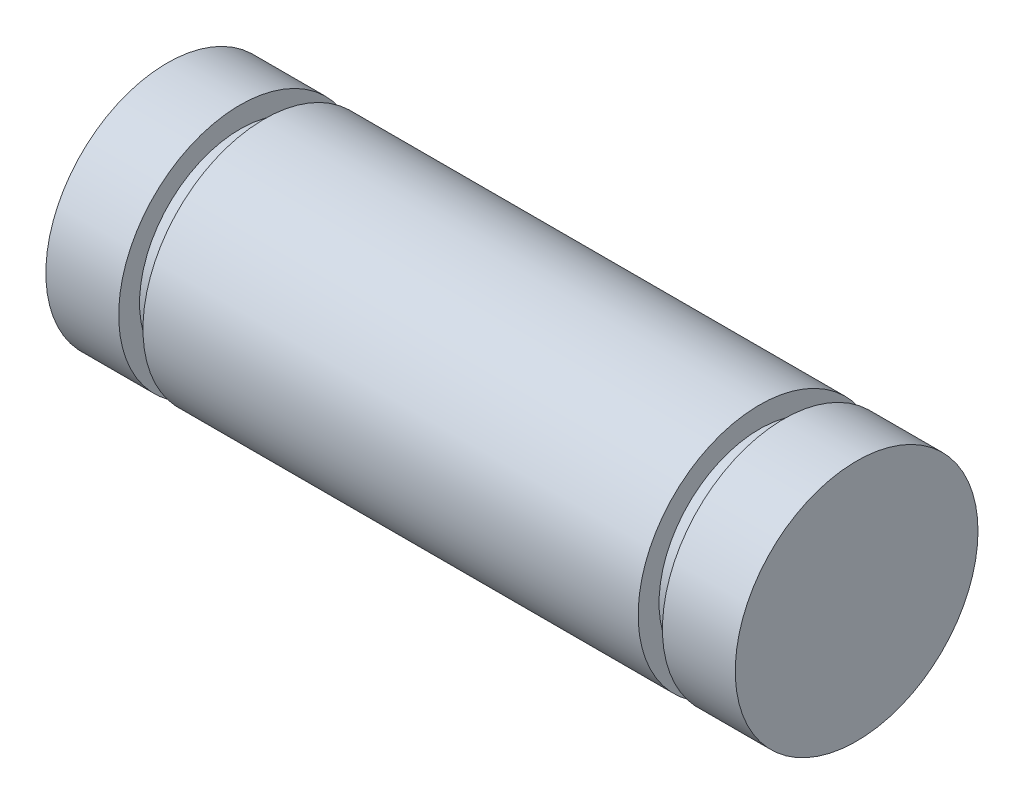
ISO-10303-21;
HEADER;
FILE_DESCRIPTION(('STEP AP214'),'2;1');
FILE_NAME('part.step','',(''),(''),'','','');
FILE_SCHEMA(('AUTOMOTIVE_DESIGN { 1 0 10303 214 1 1 1 1 }'));
ENDSEC;
DATA;
#1=APPLICATION_CONTEXT('core data for automotive mechanical design processes');
#2=APPLICATION_PROTOCOL_DEFINITION('international standard','automotive_design',2000,#1);
#3=PRODUCT_CONTEXT('',#1,'mechanical');
#4=PRODUCT('Part','Part','',(#3));
#5=PRODUCT_RELATED_PRODUCT_CATEGORY('part','',(#4));
#6=PRODUCT_DEFINITION_FORMATION('','',#4);
#7=PRODUCT_DEFINITION_CONTEXT('part definition',#1,'design');
#8=PRODUCT_DEFINITION('design','',#6,#7);
#9=PRODUCT_DEFINITION_SHAPE('','',#8);
#10=(LENGTH_UNIT() NAMED_UNIT(*) SI_UNIT(.MILLI.,.METRE.));
#11=(NAMED_UNIT(*) PLANE_ANGLE_UNIT() SI_UNIT($,.RADIAN.));
#12=(NAMED_UNIT(*) SI_UNIT($,.STERADIAN.) SOLID_ANGLE_UNIT());
#13=UNCERTAINTY_MEASURE_WITH_UNIT(LENGTH_MEASURE(1.E-05),#10,'distance_accuracy_value','');
#14=(GEOMETRIC_REPRESENTATION_CONTEXT(3) GLOBAL_UNCERTAINTY_ASSIGNED_CONTEXT((#13)) GLOBAL_UNIT_ASSIGNED_CONTEXT((#10,
#11,#12)) REPRESENTATION_CONTEXT('',''));
#15=CARTESIAN_POINT('',(0.,0.,0.));
#16=DIRECTION('',(0.,0.,1.));
#17=DIRECTION('',(1.,0.,0.));
#18=AXIS2_PLACEMENT_3D('',#15,#16,#17);
#19=CARTESIAN_POINT('',(9.017,0.,0.));
#20=DIRECTION('',(-1.,0.,0.));
#21=DIRECTION('',(0.,0.,1.));
#22=AXIS2_PLACEMENT_3D('',#19,#20,#21);
#23=CYLINDRICAL_SURFACE('',#22,3.175);
#24=CARTESIAN_POINT('',(6.477,0.,0.));
#25=DIRECTION('',(1.,0.,0.));
#26=DIRECTION('',(0.,0.,-1.));
#27=AXIS2_PLACEMENT_3D('',#24,#25,#26);
#28=CIRCLE('',#27,3.175);
#29=CARTESIAN_POINT('',(6.477,0.,-3.175));
#30=VERTEX_POINT('',#29);
#31=EDGE_CURVE('E57',#30,#30,#28,.T.);
#32=ORIENTED_EDGE('',*,*,#31,.F.);
#33=EDGE_LOOP('',(#32));
#34=FACE_BOUND('',#33,.T.);
#35=CARTESIAN_POINT('',(-6.477,0.,0.));
#36=DIRECTION('',(1.,0.,0.));
#37=DIRECTION('',(0.,0.,-1.));
#38=AXIS2_PLACEMENT_3D('',#35,#36,#37);
#39=CIRCLE('',#38,3.175);
#40=CARTESIAN_POINT('',(-6.477,0.,-3.175));
#41=VERTEX_POINT('',#40);
#42=EDGE_CURVE('E51',#41,#41,#39,.T.);
#43=ORIENTED_EDGE('',*,*,#42,.T.);
#44=EDGE_LOOP('',(#43));
#45=FACE_BOUND('',#44,.T.);
#46=ADVANCED_FACE('F33',(#34,#45),#23,.T.);
#47=CARTESIAN_POINT('',(-7.112,0.,0.));
#48=DIRECTION('',(1.,0.,0.));
#49=DIRECTION('',(0.,0.,-1.));
#50=AXIS2_PLACEMENT_3D('',#47,#48,#49);
#51=CIRCLE('',#50,3.175);
#52=CARTESIAN_POINT('',(-7.112,0.,-3.175));
#53=VERTEX_POINT('',#52);
#54=EDGE_CURVE('E54',#53,#53,#51,.T.);
#55=ORIENTED_EDGE('',*,*,#54,.F.);
#56=EDGE_LOOP('',(#55));
#57=FACE_BOUND('',#56,.T.);
#58=CARTESIAN_POINT('',(-9.017,0.,0.));
#59=DIRECTION('',(1.,0.,0.));
#60=DIRECTION('',(0.,0.,-1.));
#61=AXIS2_PLACEMENT_3D('',#58,#59,#60);
#62=CIRCLE('',#61,3.175);
#63=CARTESIAN_POINT('',(-9.017,0.,-3.175));
#64=VERTEX_POINT('',#63);
#65=EDGE_CURVE('E37',#64,#64,#62,.T.);
#66=ORIENTED_EDGE('',*,*,#65,.T.);
#67=EDGE_LOOP('',(#66));
#68=FACE_BOUND('',#67,.T.);
#69=ADVANCED_FACE('F94',(#57,#68),#23,.T.);
#70=CARTESIAN_POINT('',(-9.017,0.,0.));
#71=DIRECTION('',(1.,0.,0.));
#72=DIRECTION('',(0.,0.,-1.));
#73=AXIS2_PLACEMENT_3D('',#70,#71,#72);
#74=PLANE('',#73);
#75=ORIENTED_EDGE('',*,*,#65,.F.);
#76=EDGE_LOOP('',(#75));
#77=FACE_BOUND('',#76,.T.);
#78=ADVANCED_FACE('F111',(#77),#74,.F.);
#79=CARTESIAN_POINT('',(-7.112,3.175,0.));
#80=DIRECTION('',(-1.,0.,0.));
#81=DIRECTION('',(0.,0.,1.));
#82=AXIS2_PLACEMENT_3D('',#79,#80,#81);
#83=PLANE('',#82);
#84=CARTESIAN_POINT('',(-7.112,0.,0.));
#85=DIRECTION('',(1.,0.,0.));
#86=DIRECTION('',(0.,0.,-1.));
#87=AXIS2_PLACEMENT_3D('',#84,#85,#86);
#88=CIRCLE('',#87,2.6289);
#89=CARTESIAN_POINT('',(-7.112,0.,-2.6289));
#90=VERTEX_POINT('',#89);
#91=EDGE_CURVE('E44',#90,#90,#88,.T.);
#92=ORIENTED_EDGE('',*,*,#91,.F.);
#93=EDGE_LOOP('',(#92));
#94=FACE_BOUND('',#93,.T.);
#95=ORIENTED_EDGE('',*,*,#54,.T.);
#96=EDGE_LOOP('',(#95));
#97=FACE_BOUND('',#96,.T.);
#98=ADVANCED_FACE('F105',(#94,#97),#83,.F.);
#99=CARTESIAN_POINT('',(0.,0.,0.));
#100=DIRECTION('',(1.,0.,0.));
#101=DIRECTION('',(0.,0.,-1.));
#102=AXIS2_PLACEMENT_3D('',#99,#100,#101);
#103=CYLINDRICAL_SURFACE('',#102,2.6289);
#104=CARTESIAN_POINT('',(-6.477,0.,0.));
#105=DIRECTION('',(1.,0.,0.));
#106=DIRECTION('',(0.,0.,-1.));
#107=AXIS2_PLACEMENT_3D('',#104,#105,#106);
#108=CIRCLE('',#107,2.6289);
#109=CARTESIAN_POINT('',(-6.477,0.,-2.6289));
#110=VERTEX_POINT('',#109);
#111=EDGE_CURVE('E48',#110,#110,#108,.T.);
#112=ORIENTED_EDGE('',*,*,#111,.F.);
#113=EDGE_LOOP('',(#112));
#114=FACE_BOUND('',#113,.T.);
#115=ORIENTED_EDGE('',*,*,#91,.T.);
#116=EDGE_LOOP('',(#115));
#117=FACE_BOUND('',#116,.T.);
#118=ADVANCED_FACE('F99',(#114,#117),#103,.T.);
#119=CARTESIAN_POINT('',(-6.477,3.175,0.));
#120=DIRECTION('',(1.,0.,0.));
#121=DIRECTION('',(0.,0.,-1.));
#122=AXIS2_PLACEMENT_3D('',#119,#120,#121);
#123=PLANE('',#122);
#124=ORIENTED_EDGE('',*,*,#42,.F.);
#125=EDGE_LOOP('',(#124));
#126=FACE_BOUND('',#125,.T.);
#127=ORIENTED_EDGE('',*,*,#111,.T.);
#128=EDGE_LOOP('',(#127));
#129=FACE_BOUND('',#128,.T.);
#130=ADVANCED_FACE('F88',(#126,#129),#123,.F.);
#131=CARTESIAN_POINT('',(6.477,3.175,0.));
#132=DIRECTION('',(-1.,0.,0.));
#133=DIRECTION('',(0.,0.,1.));
#134=AXIS2_PLACEMENT_3D('',#131,#132,#133);
#135=PLANE('',#134);
#136=CARTESIAN_POINT('',(6.477,0.,0.));
#137=DIRECTION('',(1.,0.,0.));
#138=DIRECTION('',(0.,0.,-1.));
#139=AXIS2_PLACEMENT_3D('',#136,#137,#138);
#140=CIRCLE('',#139,2.6289);
#141=CARTESIAN_POINT('',(6.477,0.,-2.6289));
#142=VERTEX_POINT('',#141);
#143=EDGE_CURVE('E60',#142,#142,#140,.T.);
#144=ORIENTED_EDGE('',*,*,#143,.F.);
#145=EDGE_LOOP('',(#144));
#146=FACE_BOUND('',#145,.T.);
#147=ORIENTED_EDGE('',*,*,#31,.T.);
#148=EDGE_LOOP('',(#147));
#149=FACE_BOUND('',#148,.T.);
#150=ADVANCED_FACE('F82',(#146,#149),#135,.F.);
#151=CARTESIAN_POINT('',(0.,0.,0.));
#152=DIRECTION('',(1.,0.,0.));
#153=DIRECTION('',(0.,0.,-1.));
#154=AXIS2_PLACEMENT_3D('',#151,#152,#153);
#155=CYLINDRICAL_SURFACE('',#154,2.6289);
#156=CARTESIAN_POINT('',(7.112,0.,0.));
#157=DIRECTION('',(1.,0.,0.));
#158=DIRECTION('',(0.,0.,-1.));
#159=AXIS2_PLACEMENT_3D('',#156,#157,#158);
#160=CIRCLE('',#159,2.6289);
#161=CARTESIAN_POINT('',(7.112,0.,-2.6289));
#162=VERTEX_POINT('',#161);
#163=EDGE_CURVE('E63',#162,#162,#160,.T.);
#164=ORIENTED_EDGE('',*,*,#163,.F.);
#165=EDGE_LOOP('',(#164));
#166=FACE_BOUND('',#165,.T.);
#167=ORIENTED_EDGE('',*,*,#143,.T.);
#168=EDGE_LOOP('',(#167));
#169=FACE_BOUND('',#168,.T.);
#170=ADVANCED_FACE('F76',(#166,#169),#155,.T.);
#171=CARTESIAN_POINT('',(7.112,3.175,0.));
#172=DIRECTION('',(1.,0.,0.));
#173=DIRECTION('',(0.,0.,-1.));
#174=AXIS2_PLACEMENT_3D('',#171,#172,#173);
#175=PLANE('',#174);
#176=CARTESIAN_POINT('',(7.112,0.,0.));
#177=DIRECTION('',(1.,0.,0.));
#178=DIRECTION('',(0.,0.,-1.));
#179=AXIS2_PLACEMENT_3D('',#176,#177,#178);
#180=CIRCLE('',#179,3.175);
#181=CARTESIAN_POINT('',(7.112,0.,-3.175));
#182=VERTEX_POINT('',#181);
#183=EDGE_CURVE('E66',#182,#182,#180,.T.);
#184=ORIENTED_EDGE('',*,*,#183,.F.);
#185=EDGE_LOOP('',(#184));
#186=FACE_BOUND('',#185,.T.);
#187=ORIENTED_EDGE('',*,*,#163,.T.);
#188=EDGE_LOOP('',(#187));
#189=FACE_BOUND('',#188,.T.);
#190=ADVANCED_FACE('F72',(#186,#189),#175,.F.);
#191=CARTESIAN_POINT('',(9.017,0.,0.));
#192=DIRECTION('',(1.,0.,0.));
#193=DIRECTION('',(0.,0.,-1.));
#194=AXIS2_PLACEMENT_3D('',#191,#192,#193);
#195=PLANE('',#194);
#196=CARTESIAN_POINT('',(9.017,0.,0.));
#197=DIRECTION('',(1.,0.,0.));
#198=DIRECTION('',(0.,0.,-1.));
#199=AXIS2_PLACEMENT_3D('',#196,#197,#198);
#200=CIRCLE('',#199,3.175);
#201=CARTESIAN_POINT('',(9.017,0.,-3.175));
#202=VERTEX_POINT('',#201);
#203=EDGE_CURVE('E10',#202,#202,#200,.T.);
#204=ORIENTED_EDGE('',*,*,#203,.T.);
#205=EDGE_LOOP('',(#204));
#206=FACE_BOUND('',#205,.T.);
#207=ADVANCED_FACE('F75',(#206),#195,.T.);
#208=ORIENTED_EDGE('',*,*,#183,.T.);
#209=EDGE_LOOP('',(#208));
#210=FACE_BOUND('',#209,.T.);
#211=ORIENTED_EDGE('',*,*,#203,.F.);
#212=EDGE_LOOP('',(#211));
#213=FACE_BOUND('',#212,.T.);
#214=ADVANCED_FACE('F35',(#210,#213),#23,.T.);
#215=CLOSED_SHELL('',(#46,#69,#78,#98,#118,#130,#150,#170,#190,#207,#214));
#216=MANIFOLD_SOLID_BREP('B2',#215);
#217=ADVANCED_BREP_SHAPE_REPRESENTATION('',(#18,#216),#14);
#218=SHAPE_DEFINITION_REPRESENTATION(#9,#217);
ENDSEC;
END-ISO-10303-21;
